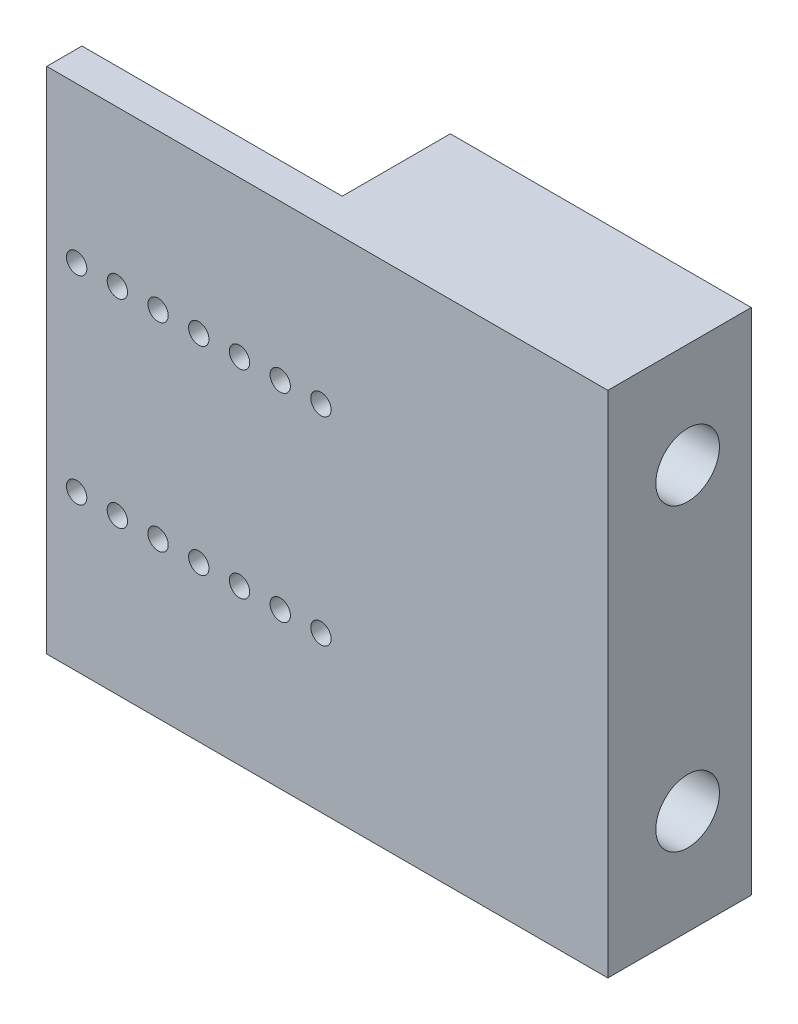
ISO-10303-21;
HEADER;
FILE_DESCRIPTION(('STEP AP214'),'2;1');
FILE_NAME('part.step','',(''),(''),'','','');
FILE_SCHEMA(('AUTOMOTIVE_DESIGN { 1 0 10303 214 1 1 1 1 }'));
ENDSEC;
DATA;
#1=APPLICATION_CONTEXT('core data for automotive mechanical design processes');
#2=APPLICATION_PROTOCOL_DEFINITION('international standard','automotive_design',2000,#1);
#3=PRODUCT_CONTEXT('',#1,'mechanical');
#4=PRODUCT('Part','Part','',(#3));
#5=PRODUCT_RELATED_PRODUCT_CATEGORY('part','',(#4));
#6=PRODUCT_DEFINITION_FORMATION('','',#4);
#7=PRODUCT_DEFINITION_CONTEXT('part definition',#1,'design');
#8=PRODUCT_DEFINITION('design','',#6,#7);
#9=PRODUCT_DEFINITION_SHAPE('','',#8);
#10=(LENGTH_UNIT() NAMED_UNIT(*) SI_UNIT(.MILLI.,.METRE.));
#11=(NAMED_UNIT(*) PLANE_ANGLE_UNIT() SI_UNIT($,.RADIAN.));
#12=(NAMED_UNIT(*) SI_UNIT($,.STERADIAN.) SOLID_ANGLE_UNIT());
#13=UNCERTAINTY_MEASURE_WITH_UNIT(LENGTH_MEASURE(1.E-05),#10,'distance_accuracy_value','');
#14=(GEOMETRIC_REPRESENTATION_CONTEXT(3) GLOBAL_UNCERTAINTY_ASSIGNED_CONTEXT((#13)) GLOBAL_UNIT_ASSIGNED_CONTEXT((#10,
#11,#12)) REPRESENTATION_CONTEXT('',''));
#15=CARTESIAN_POINT('',(0.,0.,0.));
#16=DIRECTION('',(0.,0.,1.));
#17=DIRECTION('',(1.,0.,0.));
#18=AXIS2_PLACEMENT_3D('',#15,#16,#17);
#19=CARTESIAN_POINT('',(0.,0.,-15.));
#20=DIRECTION('',(0.,0.,1.));
#21=DIRECTION('',(1.,0.,0.));
#22=AXIS2_PLACEMENT_3D('',#19,#20,#21);
#23=PLANE('',#22);
#24=DIRECTION('',(0.,-1.,0.));
#25=VECTOR('',#24,1.);
#26=CARTESIAN_POINT('',(40.9,58.8,-15.));
#27=LINE('',#26,#25);
#28=CARTESIAN_POINT('',(40.9,58.8,-15.));
#29=VERTEX_POINT('',#28);
#30=CARTESIAN_POINT('',(40.9,-21.2,-15.));
#31=VERTEX_POINT('',#30);
#32=EDGE_CURVE('E93',#29,#31,#27,.T.);
#33=ORIENTED_EDGE('',*,*,#32,.F.);
#34=DIRECTION('',(1.,0.,0.));
#35=VECTOR('',#34,1.);
#36=CARTESIAN_POINT('',(88.2,58.8,-15.));
#37=LINE('',#36,#35);
#38=CARTESIAN_POINT('',(88.2,58.8,-15.));
#39=VERTEX_POINT('',#38);
#40=EDGE_CURVE('E113',#29,#39,#37,.T.);
#41=ORIENTED_EDGE('',*,*,#40,.T.);
#42=DIRECTION('',(0.,-1.,0.));
#43=VECTOR('',#42,1.);
#44=CARTESIAN_POINT('',(88.2,-21.2,-15.));
#45=LINE('',#44,#43);
#46=CARTESIAN_POINT('',(88.2,-21.2,-15.));
#47=VERTEX_POINT('',#46);
#48=EDGE_CURVE('E112',#39,#47,#45,.T.);
#49=ORIENTED_EDGE('',*,*,#48,.T.);
#50=DIRECTION('',(-1.,0.,0.));
#51=VECTOR('',#50,1.);
#52=CARTESIAN_POINT('',(88.2,-21.2,-15.));
#53=LINE('',#52,#51);
#54=EDGE_CURVE('E106',#47,#31,#53,.T.);
#55=ORIENTED_EDGE('',*,*,#54,.T.);
#56=EDGE_LOOP('',(#33,#41,#49,#55));
#57=FACE_BOUND('',#56,.T.);
#58=ADVANCED_FACE('F38',(#57),#23,.F.);
#59=CARTESIAN_POINT('',(0.,0.,7.54));
#60=DIRECTION('',(0.,0.,1.));
#61=DIRECTION('',(1.,0.,0.));
#62=AXIS2_PLACEMENT_3D('',#59,#60,#61);
#63=PLANE('',#62);
#64=CARTESIAN_POINT('',(11.1,3.2,7.54));
#65=DIRECTION('',(0.,0.,1.));
#66=DIRECTION('',(-1.,0.,0.));
#67=AXIS2_PLACEMENT_3D('',#64,#65,#66);
#68=CIRCLE('',#67,1.6);
#69=CARTESIAN_POINT('',(9.49999999999999,3.2,7.54));
#70=VERTEX_POINT('',#69);
#71=EDGE_CURVE('E123',#70,#70,#68,.T.);
#72=ORIENTED_EDGE('',*,*,#71,.F.);
#73=EDGE_LOOP('',(#72));
#74=FACE_BOUND('',#73,.T.);
#75=CARTESIAN_POINT('',(23.9,3.2,7.54));
#76=DIRECTION('',(0.,0.,1.));
#77=DIRECTION('',(-1.,0.,0.));
#78=AXIS2_PLACEMENT_3D('',#75,#76,#77);
#79=CIRCLE('',#78,1.6);
#80=CARTESIAN_POINT('',(22.3,3.2,7.54));
#81=VERTEX_POINT('',#80);
#82=EDGE_CURVE('E129',#81,#81,#79,.T.);
#83=ORIENTED_EDGE('',*,*,#82,.F.);
#84=EDGE_LOOP('',(#83));
#85=FACE_BOUND('',#84,.T.);
#86=CARTESIAN_POINT('',(36.7,3.2,7.54));
#87=DIRECTION('',(0.,0.,1.));
#88=DIRECTION('',(-1.,0.,0.));
#89=AXIS2_PLACEMENT_3D('',#86,#87,#88);
#90=CIRCLE('',#89,1.6);
#91=CARTESIAN_POINT('',(35.1,3.2,7.54));
#92=VERTEX_POINT('',#91);
#93=EDGE_CURVE('E135',#92,#92,#90,.T.);
#94=ORIENTED_EDGE('',*,*,#93,.F.);
#95=EDGE_LOOP('',(#94));
#96=FACE_BOUND('',#95,.T.);
#97=CARTESIAN_POINT('',(36.7,34.4,7.54));
#98=DIRECTION('',(0.,0.,1.));
#99=DIRECTION('',(1.,0.,0.));
#100=AXIS2_PLACEMENT_3D('',#97,#98,#99);
#101=CIRCLE('',#100,1.6);
#102=CARTESIAN_POINT('',(38.3,34.4,7.54));
#103=VERTEX_POINT('',#102);
#104=EDGE_CURVE('E142',#103,#103,#101,.T.);
#105=ORIENTED_EDGE('',*,*,#104,.F.);
#106=EDGE_LOOP('',(#105));
#107=FACE_BOUND('',#106,.T.);
#108=CARTESIAN_POINT('',(23.9,34.4,7.54));
#109=DIRECTION('',(0.,0.,1.));
#110=DIRECTION('',(1.,0.,0.));
#111=AXIS2_PLACEMENT_3D('',#108,#109,#110);
#112=CIRCLE('',#111,1.6);
#113=CARTESIAN_POINT('',(25.5,34.4,7.54));
#114=VERTEX_POINT('',#113);
#115=EDGE_CURVE('E150',#114,#114,#112,.T.);
#116=ORIENTED_EDGE('',*,*,#115,.F.);
#117=EDGE_LOOP('',(#116));
#118=FACE_BOUND('',#117,.T.);
#119=CARTESIAN_POINT('',(11.1,34.4,7.54));
#120=DIRECTION('',(0.,0.,1.));
#121=DIRECTION('',(1.,0.,0.));
#122=AXIS2_PLACEMENT_3D('',#119,#120,#121);
#123=CIRCLE('',#122,1.6);
#124=CARTESIAN_POINT('',(12.7,34.4,7.54));
#125=VERTEX_POINT('',#124);
#126=EDGE_CURVE('E156',#125,#125,#123,.T.);
#127=ORIENTED_EDGE('',*,*,#126,.F.);
#128=EDGE_LOOP('',(#127));
#129=FACE_BOUND('',#128,.T.);
#130=CARTESIAN_POINT('',(4.7,34.4,7.54));
#131=DIRECTION('',(0.,0.,1.));
#132=DIRECTION('',(1.,0.,0.));
#133=AXIS2_PLACEMENT_3D('',#130,#131,#132);
#134=CIRCLE('',#133,1.6);
#135=CARTESIAN_POINT('',(6.3,34.4,7.54));
#136=VERTEX_POINT('',#135);
#137=EDGE_CURVE('E163',#136,#136,#134,.T.);
#138=ORIENTED_EDGE('',*,*,#137,.F.);
#139=EDGE_LOOP('',(#138));
#140=FACE_BOUND('',#139,.T.);
#141=DIRECTION('',(0.,-1.,0.));
#142=VECTOR('',#141,1.);
#143=CARTESIAN_POINT('',(0.,0.,7.54));
#144=LINE('',#143,#142);
#145=CARTESIAN_POINT('',(0.,58.8,7.54));
#146=VERTEX_POINT('',#145);
#147=CARTESIAN_POINT('',(0.,-21.2,7.54));
#148=VERTEX_POINT('',#147);
#149=EDGE_CURVE('E63',#146,#148,#144,.T.);
#150=ORIENTED_EDGE('',*,*,#149,.T.);
#151=DIRECTION('',(1.,0.,0.));
#152=VECTOR('',#151,1.);
#153=CARTESIAN_POINT('',(0.,-21.2,7.54));
#154=LINE('',#153,#152);
#155=CARTESIAN_POINT('',(88.2,-21.2,7.54));
#156=VERTEX_POINT('',#155);
#157=EDGE_CURVE('E169',#148,#156,#154,.T.);
#158=ORIENTED_EDGE('',*,*,#157,.T.);
#159=DIRECTION('',(0.,1.,0.));
#160=VECTOR('',#159,1.);
#161=CARTESIAN_POINT('',(88.2,-21.2,7.54));
#162=LINE('',#161,#160);
#163=CARTESIAN_POINT('',(88.2,58.8,7.54));
#164=VERTEX_POINT('',#163);
#165=EDGE_CURVE('E171',#156,#164,#162,.T.);
#166=ORIENTED_EDGE('',*,*,#165,.T.);
#167=DIRECTION('',(-1.,0.,0.));
#168=VECTOR('',#167,1.);
#169=CARTESIAN_POINT('',(0.,58.8,7.54));
#170=LINE('',#169,#168);
#171=EDGE_CURVE('E173',#164,#146,#170,.T.);
#172=ORIENTED_EDGE('',*,*,#171,.T.);
#173=EDGE_LOOP('',(#150,#158,#166,#172));
#174=FACE_BOUND('',#173,.T.);
#175=CARTESIAN_POINT('',(43.1,3.2,7.54));
#176=DIRECTION('',(0.,0.,1.));
#177=DIRECTION('',(-1.,0.,0.));
#178=AXIS2_PLACEMENT_3D('',#175,#176,#177);
#179=CIRCLE('',#178,1.6);
#180=CARTESIAN_POINT('',(41.5,3.2,7.54));
#181=VERTEX_POINT('',#180);
#182=EDGE_CURVE('E160',#181,#181,#179,.T.);
#183=ORIENTED_EDGE('',*,*,#182,.F.);
#184=EDGE_LOOP('',(#183));
#185=FACE_BOUND('',#184,.T.);
#186=CARTESIAN_POINT('',(17.5,34.4,7.54));
#187=DIRECTION('',(0.,0.,1.));
#188=DIRECTION('',(1.,0.,0.));
#189=AXIS2_PLACEMENT_3D('',#186,#187,#188);
#190=CIRCLE('',#189,1.6);
#191=CARTESIAN_POINT('',(19.1,34.4,7.54));
#192=VERTEX_POINT('',#191);
#193=EDGE_CURVE('E153',#192,#192,#190,.T.);
#194=ORIENTED_EDGE('',*,*,#193,.F.);
#195=EDGE_LOOP('',(#194));
#196=FACE_BOUND('',#195,.T.);
#197=CARTESIAN_POINT('',(30.3,34.4,7.54));
#198=DIRECTION('',(0.,0.,1.));
#199=DIRECTION('',(1.,0.,0.));
#200=AXIS2_PLACEMENT_3D('',#197,#198,#199);
#201=CIRCLE('',#200,1.6);
#202=CARTESIAN_POINT('',(31.9,34.4,7.54));
#203=VERTEX_POINT('',#202);
#204=EDGE_CURVE('E147',#203,#203,#201,.T.);
#205=ORIENTED_EDGE('',*,*,#204,.F.);
#206=EDGE_LOOP('',(#205));
#207=FACE_BOUND('',#206,.T.);
#208=CARTESIAN_POINT('',(43.1,34.4,7.54));
#209=DIRECTION('',(0.,0.,1.));
#210=DIRECTION('',(1.,0.,0.));
#211=AXIS2_PLACEMENT_3D('',#208,#209,#210);
#212=CIRCLE('',#211,1.6);
#213=CARTESIAN_POINT('',(44.7,34.4,7.54));
#214=VERTEX_POINT('',#213);
#215=EDGE_CURVE('E139',#214,#214,#212,.T.);
#216=ORIENTED_EDGE('',*,*,#215,.F.);
#217=EDGE_LOOP('',(#216));
#218=FACE_BOUND('',#217,.T.);
#219=CARTESIAN_POINT('',(30.3,3.2,7.54));
#220=DIRECTION('',(0.,0.,1.));
#221=DIRECTION('',(-1.,0.,0.));
#222=AXIS2_PLACEMENT_3D('',#219,#220,#221);
#223=CIRCLE('',#222,1.59999999999998);
#224=CARTESIAN_POINT('',(28.7,3.2,7.54));
#225=VERTEX_POINT('',#224);
#226=EDGE_CURVE('E132',#225,#225,#223,.T.);
#227=ORIENTED_EDGE('',*,*,#226,.F.);
#228=EDGE_LOOP('',(#227));
#229=FACE_BOUND('',#228,.T.);
#230=CARTESIAN_POINT('',(17.5,3.2,7.54));
#231=DIRECTION('',(0.,0.,1.));
#232=DIRECTION('',(-1.,0.,0.));
#233=AXIS2_PLACEMENT_3D('',#230,#231,#232);
#234=CIRCLE('',#233,1.6);
#235=CARTESIAN_POINT('',(15.9,3.2,7.54));
#236=VERTEX_POINT('',#235);
#237=EDGE_CURVE('E126',#236,#236,#234,.T.);
#238=ORIENTED_EDGE('',*,*,#237,.F.);
#239=EDGE_LOOP('',(#238));
#240=FACE_BOUND('',#239,.T.);
#241=CARTESIAN_POINT('',(4.7,3.2,7.54));
#242=DIRECTION('',(0.,0.,1.));
#243=DIRECTION('',(-1.,0.,0.));
#244=AXIS2_PLACEMENT_3D('',#241,#242,#243);
#245=CIRCLE('',#244,1.6);
#246=CARTESIAN_POINT('',(3.1,3.2,7.54));
#247=VERTEX_POINT('',#246);
#248=EDGE_CURVE('E115',#247,#247,#245,.T.);
#249=ORIENTED_EDGE('',*,*,#248,.F.);
#250=EDGE_LOOP('',(#249));
#251=FACE_BOUND('',#250,.T.);
#252=ADVANCED_FACE('F248',(#74,#85,#96,#107,#118,#129,#140,#174,#185,#196,#207,#218,#229,#240,
#251),#63,.T.);
#253=CARTESIAN_POINT('',(0.,-21.2,7.54));
#254=DIRECTION('',(0.,1.,0.));
#255=DIRECTION('',(0.,0.,1.));
#256=AXIS2_PLACEMENT_3D('',#253,#254,#255);
#257=PLANE('',#256);
#258=DIRECTION('',(0.,0.,-1.));
#259=VECTOR('',#258,1.);
#260=CARTESIAN_POINT('',(0.,-21.2,7.54));
#261=LINE('',#260,#259);
#262=CARTESIAN_POINT('',(0.,-21.2,2.));
#263=VERTEX_POINT('',#262);
#264=EDGE_CURVE('E11',#148,#263,#261,.T.);
#265=ORIENTED_EDGE('',*,*,#264,.T.);
#266=DIRECTION('',(-1.,0.,0.));
#267=VECTOR('',#266,1.);
#268=CARTESIAN_POINT('',(40.9,-21.2,2.));
#269=LINE('',#268,#267);
#270=CARTESIAN_POINT('',(40.9,-21.2,2.));
#271=VERTEX_POINT('',#270);
#272=EDGE_CURVE('E108',#271,#263,#269,.T.);
#273=ORIENTED_EDGE('',*,*,#272,.F.);
#274=DIRECTION('',(0.,0.,1.));
#275=VECTOR('',#274,1.);
#276=CARTESIAN_POINT('',(40.9,-21.2,-15.));
#277=LINE('',#276,#275);
#278=EDGE_CURVE('E96',#31,#271,#277,.T.);
#279=ORIENTED_EDGE('',*,*,#278,.F.);
#280=ORIENTED_EDGE('',*,*,#54,.F.);
#281=DIRECTION('',(0.,0.,-1.));
#282=VECTOR('',#281,1.);
#283=CARTESIAN_POINT('',(88.2,-21.2,7.54));
#284=LINE('',#283,#282);
#285=EDGE_CURVE('E47',#156,#47,#284,.T.);
#286=ORIENTED_EDGE('',*,*,#285,.F.);
#287=ORIENTED_EDGE('',*,*,#157,.F.);
#288=EDGE_LOOP('',(#265,#273,#279,#280,#286,#287));
#289=FACE_BOUND('',#288,.T.);
#290=ADVANCED_FACE('F40',(#289),#257,.F.);
#291=CARTESIAN_POINT('',(88.2,58.8,7.54));
#292=DIRECTION('',(-1.,0.,0.));
#293=DIRECTION('',(0.,0.,1.));
#294=AXIS2_PLACEMENT_3D('',#291,#292,#293);
#295=PLANE('',#294);
#296=CARTESIAN_POINT('',(88.2,42.36,-5.));
#297=DIRECTION('',(-1.,0.,0.));
#298=DIRECTION('',(0.,0.,1.));
#299=AXIS2_PLACEMENT_3D('',#296,#297,#298);
#300=CIRCLE('',#299,5.);
#301=CARTESIAN_POINT('',(88.2,42.36,0.));
#302=VERTEX_POINT('',#301);
#303=EDGE_CURVE('E195',#302,#302,#300,.T.);
#304=ORIENTED_EDGE('',*,*,#303,.T.);
#305=EDGE_LOOP('',(#304));
#306=FACE_BOUND('',#305,.T.);
#307=CARTESIAN_POINT('',(88.2,-4.76,-5.));
#308=DIRECTION('',(-1.,0.,0.));
#309=DIRECTION('',(0.,0.,1.));
#310=AXIS2_PLACEMENT_3D('',#307,#308,#309);
#311=CIRCLE('',#310,5.);
#312=CARTESIAN_POINT('',(88.2,-4.76,0.));
#313=VERTEX_POINT('',#312);
#314=EDGE_CURVE('E187',#313,#313,#311,.T.);
#315=ORIENTED_EDGE('',*,*,#314,.T.);
#316=EDGE_LOOP('',(#315));
#317=FACE_BOUND('',#316,.T.);
#318=ORIENTED_EDGE('',*,*,#285,.T.);
#319=ORIENTED_EDGE('',*,*,#48,.F.);
#320=DIRECTION('',(0.,0.,-1.));
#321=VECTOR('',#320,1.);
#322=CARTESIAN_POINT('',(88.2,58.8,7.54));
#323=LINE('',#322,#321);
#324=EDGE_CURVE('E177',#164,#39,#323,.T.);
#325=ORIENTED_EDGE('',*,*,#324,.F.);
#326=ORIENTED_EDGE('',*,*,#165,.F.);
#327=EDGE_LOOP('',(#318,#319,#325,#326));
#328=FACE_BOUND('',#327,.T.);
#329=ADVANCED_FACE('F307',(#306,#317,#328),#295,.F.);
#330=CARTESIAN_POINT('',(0.,58.8,7.54));
#331=DIRECTION('',(0.,-1.,0.));
#332=DIRECTION('',(0.,0.,-1.));
#333=AXIS2_PLACEMENT_3D('',#330,#331,#332);
#334=PLANE('',#333);
#335=DIRECTION('',(0.,0.,-1.));
#336=VECTOR('',#335,1.);
#337=CARTESIAN_POINT('',(40.9,58.8,0.));
#338=LINE('',#337,#336);
#339=CARTESIAN_POINT('',(40.9,58.8,2.));
#340=VERTEX_POINT('',#339);
#341=EDGE_CURVE('E55',#340,#29,#338,.T.);
#342=ORIENTED_EDGE('',*,*,#341,.F.);
#343=DIRECTION('',(-1.,0.,0.));
#344=VECTOR('',#343,1.);
#345=CARTESIAN_POINT('',(40.9,58.8,2.));
#346=LINE('',#345,#344);
#347=CARTESIAN_POINT('',(0.,58.8,2.));
#348=VERTEX_POINT('',#347);
#349=EDGE_CURVE('E184',#340,#348,#346,.T.);
#350=ORIENTED_EDGE('',*,*,#349,.T.);
#351=DIRECTION('',(0.,0.,-1.));
#352=VECTOR('',#351,1.);
#353=CARTESIAN_POINT('',(0.,58.8,7.54));
#354=LINE('',#353,#352);
#355=EDGE_CURVE('E175',#146,#348,#354,.T.);
#356=ORIENTED_EDGE('',*,*,#355,.F.);
#357=ORIENTED_EDGE('',*,*,#171,.F.);
#358=ORIENTED_EDGE('',*,*,#324,.T.);
#359=ORIENTED_EDGE('',*,*,#40,.F.);
#360=EDGE_LOOP('',(#342,#350,#356,#357,#358,#359));
#361=FACE_BOUND('',#360,.T.);
#362=ADVANCED_FACE('F309',(#361),#334,.F.);
#363=CARTESIAN_POINT('',(0.,37.6,7.54));
#364=DIRECTION('',(1.,0.,0.));
#365=DIRECTION('',(0.,0.,-1.));
#366=AXIS2_PLACEMENT_3D('',#363,#364,#365);
#367=PLANE('',#366);
#368=ORIENTED_EDGE('',*,*,#355,.T.);
#369=DIRECTION('',(0.,1.,0.));
#370=VECTOR('',#369,1.);
#371=CARTESIAN_POINT('',(0.,58.8,2.));
#372=LINE('',#371,#370);
#373=EDGE_CURVE('E199',#263,#348,#372,.T.);
#374=ORIENTED_EDGE('',*,*,#373,.F.);
#375=ORIENTED_EDGE('',*,*,#264,.F.);
#376=ORIENTED_EDGE('',*,*,#149,.F.);
#377=EDGE_LOOP('',(#368,#374,#375,#376));
#378=FACE_BOUND('',#377,.T.);
#379=ADVANCED_FACE('F244',(#378),#367,.F.);
#380=CARTESIAN_POINT('',(4.7,34.4,7.54));
#381=DIRECTION('',(0.,0.,-1.));
#382=DIRECTION('',(-1.,0.,0.));
#383=AXIS2_PLACEMENT_3D('',#380,#381,#382);
#384=CYLINDRICAL_SURFACE('',#383,1.6);
#385=CARTESIAN_POINT('',(4.7,34.4,2.));
#386=DIRECTION('',(0.,0.,1.));
#387=DIRECTION('',(1.,0.,0.));
#388=AXIS2_PLACEMENT_3D('',#385,#386,#387);
#389=CIRCLE('',#388,1.6);
#390=CARTESIAN_POINT('',(6.3,34.4,2.));
#391=VERTEX_POINT('',#390);
#392=EDGE_CURVE('E117',#391,#391,#389,.T.);
#393=ORIENTED_EDGE('',*,*,#392,.F.);
#394=EDGE_LOOP('',(#393));
#395=FACE_BOUND('',#394,.T.);
#396=ORIENTED_EDGE('',*,*,#137,.T.);
#397=EDGE_LOOP('',(#396));
#398=FACE_BOUND('',#397,.T.);
#399=ADVANCED_FACE('F240',(#395,#398),#384,.F.);
#400=CARTESIAN_POINT('',(43.1,3.2,7.54));
#401=DIRECTION('',(0.,0.,-1.));
#402=DIRECTION('',(-1.,0.,0.));
#403=AXIS2_PLACEMENT_3D('',#400,#401,#402);
#404=CYLINDRICAL_SURFACE('',#403,1.6);
#405=ORIENTED_EDGE('',*,*,#182,.T.);
#406=EDGE_LOOP('',(#405));
#407=FACE_BOUND('',#406,.T.);
#408=CARTESIAN_POINT('',(43.1,3.2,0.));
#409=DIRECTION('',(0.,0.,1.));
#410=DIRECTION('',(-1.,0.,0.));
#411=AXIS2_PLACEMENT_3D('',#408,#409,#410);
#412=CIRCLE('',#411,1.6);
#413=CARTESIAN_POINT('',(41.5,3.2,0.));
#414=VERTEX_POINT('',#413);
#415=EDGE_CURVE('E159',#414,#414,#412,.T.);
#416=ORIENTED_EDGE('',*,*,#415,.F.);
#417=EDGE_LOOP('',(#416));
#418=FACE_BOUND('',#417,.T.);
#419=ADVANCED_FACE('F243',(#407,#418),#404,.F.);
#420=CARTESIAN_POINT('',(11.1,34.4,7.54));
#421=DIRECTION('',(0.,0.,-1.));
#422=DIRECTION('',(-1.,0.,0.));
#423=AXIS2_PLACEMENT_3D('',#420,#421,#422);
#424=CYLINDRICAL_SURFACE('',#423,1.6);
#425=CARTESIAN_POINT('',(11.1,34.4,2.));
#426=DIRECTION('',(0.,0.,1.));
#427=DIRECTION('',(1.,0.,0.));
#428=AXIS2_PLACEMENT_3D('',#425,#426,#427);
#429=CIRCLE('',#428,1.6);
#430=CARTESIAN_POINT('',(12.7,34.4,2.));
#431=VERTEX_POINT('',#430);
#432=EDGE_CURVE('E232',#431,#431,#429,.T.);
#433=ORIENTED_EDGE('',*,*,#432,.F.);
#434=EDGE_LOOP('',(#433));
#435=FACE_BOUND('',#434,.T.);
#436=ORIENTED_EDGE('',*,*,#126,.T.);
#437=EDGE_LOOP('',(#436));
#438=FACE_BOUND('',#437,.T.);
#439=ADVANCED_FACE('F327',(#435,#438),#424,.F.);
#440=CARTESIAN_POINT('',(17.5,34.4,7.54));
#441=DIRECTION('',(0.,0.,-1.));
#442=DIRECTION('',(-1.,0.,0.));
#443=AXIS2_PLACEMENT_3D('',#440,#441,#442);
#444=CYLINDRICAL_SURFACE('',#443,1.6);
#445=CARTESIAN_POINT('',(17.5,34.4,2.));
#446=DIRECTION('',(0.,0.,1.));
#447=DIRECTION('',(1.,0.,0.));
#448=AXIS2_PLACEMENT_3D('',#445,#446,#447);
#449=CIRCLE('',#448,1.6);
#450=CARTESIAN_POINT('',(19.1,34.4,2.));
#451=VERTEX_POINT('',#450);
#452=EDGE_CURVE('E229',#451,#451,#449,.T.);
#453=ORIENTED_EDGE('',*,*,#452,.F.);
#454=EDGE_LOOP('',(#453));
#455=FACE_BOUND('',#454,.T.);
#456=ORIENTED_EDGE('',*,*,#193,.T.);
#457=EDGE_LOOP('',(#456));
#458=FACE_BOUND('',#457,.T.);
#459=ADVANCED_FACE('F331',(#455,#458),#444,.F.);
#460=CARTESIAN_POINT('',(23.9,34.4,7.54));
#461=DIRECTION('',(0.,0.,-1.));
#462=DIRECTION('',(-1.,0.,0.));
#463=AXIS2_PLACEMENT_3D('',#460,#461,#462);
#464=CYLINDRICAL_SURFACE('',#463,1.6);
#465=CARTESIAN_POINT('',(23.9,34.4,2.));
#466=DIRECTION('',(0.,0.,1.));
#467=DIRECTION('',(1.,0.,0.));
#468=AXIS2_PLACEMENT_3D('',#465,#466,#467);
#469=CIRCLE('',#468,1.6);
#470=CARTESIAN_POINT('',(25.5,34.4,2.));
#471=VERTEX_POINT('',#470);
#472=EDGE_CURVE('E226',#471,#471,#469,.T.);
#473=ORIENTED_EDGE('',*,*,#472,.F.);
#474=EDGE_LOOP('',(#473));
#475=FACE_BOUND('',#474,.T.);
#476=ORIENTED_EDGE('',*,*,#115,.T.);
#477=EDGE_LOOP('',(#476));
#478=FACE_BOUND('',#477,.T.);
#479=ADVANCED_FACE('F335',(#475,#478),#464,.F.);
#480=CARTESIAN_POINT('',(30.3,34.4,7.54));
#481=DIRECTION('',(0.,0.,-1.));
#482=DIRECTION('',(-1.,0.,0.));
#483=AXIS2_PLACEMENT_3D('',#480,#481,#482);
#484=CYLINDRICAL_SURFACE('',#483,1.6);
#485=CARTESIAN_POINT('',(30.3,34.4,2.));
#486=DIRECTION('',(0.,0.,1.));
#487=DIRECTION('',(1.,0.,0.));
#488=AXIS2_PLACEMENT_3D('',#485,#486,#487);
#489=CIRCLE('',#488,1.6);
#490=CARTESIAN_POINT('',(31.9,34.4,2.));
#491=VERTEX_POINT('',#490);
#492=EDGE_CURVE('E223',#491,#491,#489,.T.);
#493=ORIENTED_EDGE('',*,*,#492,.F.);
#494=EDGE_LOOP('',(#493));
#495=FACE_BOUND('',#494,.T.);
#496=ORIENTED_EDGE('',*,*,#204,.T.);
#497=EDGE_LOOP('',(#496));
#498=FACE_BOUND('',#497,.T.);
#499=ADVANCED_FACE('F339',(#495,#498),#484,.F.);
#500=CARTESIAN_POINT('',(36.7,34.4,7.54));
#501=DIRECTION('',(0.,0.,-1.));
#502=DIRECTION('',(-1.,0.,0.));
#503=AXIS2_PLACEMENT_3D('',#500,#501,#502);
#504=CYLINDRICAL_SURFACE('',#503,1.6);
#505=CARTESIAN_POINT('',(36.7,34.4,2.));
#506=DIRECTION('',(0.,0.,1.));
#507=DIRECTION('',(1.,0.,0.));
#508=AXIS2_PLACEMENT_3D('',#505,#506,#507);
#509=CIRCLE('',#508,1.6);
#510=CARTESIAN_POINT('',(38.3,34.4,2.));
#511=VERTEX_POINT('',#510);
#512=EDGE_CURVE('E220',#511,#511,#509,.T.);
#513=ORIENTED_EDGE('',*,*,#512,.F.);
#514=EDGE_LOOP('',(#513));
#515=FACE_BOUND('',#514,.T.);
#516=ORIENTED_EDGE('',*,*,#104,.T.);
#517=EDGE_LOOP('',(#516));
#518=FACE_BOUND('',#517,.T.);
#519=ADVANCED_FACE('F343',(#515,#518),#504,.F.);
#520=CARTESIAN_POINT('',(43.1,34.4,7.54));
#521=DIRECTION('',(0.,0.,-1.));
#522=DIRECTION('',(-1.,0.,0.));
#523=AXIS2_PLACEMENT_3D('',#520,#521,#522);
#524=CYLINDRICAL_SURFACE('',#523,1.6);
#525=ORIENTED_EDGE('',*,*,#215,.T.);
#526=EDGE_LOOP('',(#525));
#527=FACE_BOUND('',#526,.T.);
#528=CARTESIAN_POINT('',(43.1,34.4,0.));
#529=DIRECTION('',(0.,0.,1.));
#530=DIRECTION('',(1.,0.,0.));
#531=AXIS2_PLACEMENT_3D('',#528,#529,#530);
#532=CIRCLE('',#531,1.6);
#533=CARTESIAN_POINT('',(44.7,34.4,0.));
#534=VERTEX_POINT('',#533);
#535=EDGE_CURVE('E138',#534,#534,#532,.T.);
#536=ORIENTED_EDGE('',*,*,#535,.F.);
#537=EDGE_LOOP('',(#536));
#538=FACE_BOUND('',#537,.T.);
#539=ADVANCED_FACE('F347',(#527,#538),#524,.F.);
#540=CARTESIAN_POINT('',(36.7,3.2,7.54));
#541=DIRECTION('',(0.,0.,-1.));
#542=DIRECTION('',(-1.,0.,0.));
#543=AXIS2_PLACEMENT_3D('',#540,#541,#542);
#544=CYLINDRICAL_SURFACE('',#543,1.6);
#545=CARTESIAN_POINT('',(36.7,3.2,2.));
#546=DIRECTION('',(0.,0.,1.));
#547=DIRECTION('',(1.,0.,0.));
#548=AXIS2_PLACEMENT_3D('',#545,#546,#547);
#549=CIRCLE('',#548,1.6);
#550=CARTESIAN_POINT('',(38.3,3.2,2.));
#551=VERTEX_POINT('',#550);
#552=EDGE_CURVE('E217',#551,#551,#549,.T.);
#553=ORIENTED_EDGE('',*,*,#552,.F.);
#554=EDGE_LOOP('',(#553));
#555=FACE_BOUND('',#554,.T.);
#556=ORIENTED_EDGE('',*,*,#93,.T.);
#557=EDGE_LOOP('',(#556));
#558=FACE_BOUND('',#557,.T.);
#559=ADVANCED_FACE('F351',(#555,#558),#544,.F.);
#560=CARTESIAN_POINT('',(30.3,3.2,7.54));
#561=DIRECTION('',(0.,0.,-1.));
#562=DIRECTION('',(-1.,0.,0.));
#563=AXIS2_PLACEMENT_3D('',#560,#561,#562);
#564=CYLINDRICAL_SURFACE('',#563,1.59999999999998);
#565=CARTESIAN_POINT('',(30.3,3.2,2.));
#566=DIRECTION('',(0.,0.,1.));
#567=DIRECTION('',(1.,0.,0.));
#568=AXIS2_PLACEMENT_3D('',#565,#566,#567);
#569=CIRCLE('',#568,1.59999999999998);
#570=CARTESIAN_POINT('',(31.9,3.2,2.));
#571=VERTEX_POINT('',#570);
#572=EDGE_CURVE('E214',#571,#571,#569,.T.);
#573=ORIENTED_EDGE('',*,*,#572,.F.);
#574=EDGE_LOOP('',(#573));
#575=FACE_BOUND('',#574,.T.);
#576=ORIENTED_EDGE('',*,*,#226,.T.);
#577=EDGE_LOOP('',(#576));
#578=FACE_BOUND('',#577,.T.);
#579=ADVANCED_FACE('F355',(#575,#578),#564,.F.);
#580=CARTESIAN_POINT('',(23.9,3.2,7.54));
#581=DIRECTION('',(0.,0.,-1.));
#582=DIRECTION('',(-1.,0.,0.));
#583=AXIS2_PLACEMENT_3D('',#580,#581,#582);
#584=CYLINDRICAL_SURFACE('',#583,1.6);
#585=CARTESIAN_POINT('',(23.9,3.2,2.));
#586=DIRECTION('',(0.,0.,1.));
#587=DIRECTION('',(1.,0.,0.));
#588=AXIS2_PLACEMENT_3D('',#585,#586,#587);
#589=CIRCLE('',#588,1.6);
#590=CARTESIAN_POINT('',(25.5,3.2,2.));
#591=VERTEX_POINT('',#590);
#592=EDGE_CURVE('E211',#591,#591,#589,.T.);
#593=ORIENTED_EDGE('',*,*,#592,.F.);
#594=EDGE_LOOP('',(#593));
#595=FACE_BOUND('',#594,.T.);
#596=ORIENTED_EDGE('',*,*,#82,.T.);
#597=EDGE_LOOP('',(#596));
#598=FACE_BOUND('',#597,.T.);
#599=ADVANCED_FACE('F359',(#595,#598),#584,.F.);
#600=CARTESIAN_POINT('',(17.5,3.2,7.54));
#601=DIRECTION('',(0.,0.,-1.));
#602=DIRECTION('',(-1.,0.,0.));
#603=AXIS2_PLACEMENT_3D('',#600,#601,#602);
#604=CYLINDRICAL_SURFACE('',#603,1.6);
#605=CARTESIAN_POINT('',(17.5,3.2,2.));
#606=DIRECTION('',(0.,0.,1.));
#607=DIRECTION('',(1.,0.,0.));
#608=AXIS2_PLACEMENT_3D('',#605,#606,#607);
#609=CIRCLE('',#608,1.6);
#610=CARTESIAN_POINT('',(19.1,3.2,2.));
#611=VERTEX_POINT('',#610);
#612=EDGE_CURVE('E208',#611,#611,#609,.T.);
#613=ORIENTED_EDGE('',*,*,#612,.F.);
#614=EDGE_LOOP('',(#613));
#615=FACE_BOUND('',#614,.T.);
#616=ORIENTED_EDGE('',*,*,#237,.T.);
#617=EDGE_LOOP('',(#616));
#618=FACE_BOUND('',#617,.T.);
#619=ADVANCED_FACE('F281',(#615,#618),#604,.F.);
#620=CARTESIAN_POINT('',(11.1,3.2,7.54));
#621=DIRECTION('',(0.,0.,-1.));
#622=DIRECTION('',(-1.,0.,0.));
#623=AXIS2_PLACEMENT_3D('',#620,#621,#622);
#624=CYLINDRICAL_SURFACE('',#623,1.6);
#625=CARTESIAN_POINT('',(11.1,3.2,2.));
#626=DIRECTION('',(0.,0.,1.));
#627=DIRECTION('',(1.,0.,0.));
#628=AXIS2_PLACEMENT_3D('',#625,#626,#627);
#629=CIRCLE('',#628,1.6);
#630=CARTESIAN_POINT('',(12.7,3.2,2.));
#631=VERTEX_POINT('',#630);
#632=EDGE_CURVE('E183',#631,#631,#629,.T.);
#633=ORIENTED_EDGE('',*,*,#632,.F.);
#634=EDGE_LOOP('',(#633));
#635=FACE_BOUND('',#634,.T.);
#636=ORIENTED_EDGE('',*,*,#71,.T.);
#637=EDGE_LOOP('',(#636));
#638=FACE_BOUND('',#637,.T.);
#639=ADVANCED_FACE('F271',(#635,#638),#624,.F.);
#640=CARTESIAN_POINT('',(4.7,3.2,7.54));
#641=DIRECTION('',(0.,0.,-1.));
#642=DIRECTION('',(-1.,0.,0.));
#643=AXIS2_PLACEMENT_3D('',#640,#641,#642);
#644=CYLINDRICAL_SURFACE('',#643,1.6);
#645=CARTESIAN_POINT('',(4.7,3.2,2.));
#646=DIRECTION('',(0.,0.,1.));
#647=DIRECTION('',(1.,0.,0.));
#648=AXIS2_PLACEMENT_3D('',#645,#646,#647);
#649=CIRCLE('',#648,1.6);
#650=CARTESIAN_POINT('',(6.3,3.2,2.));
#651=VERTEX_POINT('',#650);
#652=EDGE_CURVE('E181',#651,#651,#649,.T.);
#653=ORIENTED_EDGE('',*,*,#652,.F.);
#654=EDGE_LOOP('',(#653));
#655=FACE_BOUND('',#654,.T.);
#656=ORIENTED_EDGE('',*,*,#248,.T.);
#657=EDGE_LOOP('',(#656));
#658=FACE_BOUND('',#657,.T.);
#659=ADVANCED_FACE('F268',(#655,#658),#644,.F.);
#660=CARTESIAN_POINT('',(0.,0.,0.));
#661=DIRECTION('',(0.,0.,1.));
#662=DIRECTION('',(1.,0.,0.));
#663=AXIS2_PLACEMENT_3D('',#660,#661,#662);
#664=PLANE('',#663);
#665=ORIENTED_EDGE('',*,*,#535,.T.);
#666=EDGE_LOOP('',(#665));
#667=FACE_BOUND('',#666,.T.);
#668=ADVANCED_FACE('F270',(#667),#664,.T.);
#669=ORIENTED_EDGE('',*,*,#415,.T.);
#670=EDGE_LOOP('',(#669));
#671=FACE_BOUND('',#670,.T.);
#672=ADVANCED_FACE('F278',(#671),#664,.T.);
#673=CARTESIAN_POINT('',(40.9,58.8,2.));
#674=DIRECTION('',(0.,0.,1.));
#675=DIRECTION('',(1.,0.,0.));
#676=AXIS2_PLACEMENT_3D('',#673,#674,#675);
#677=PLANE('',#676);
#678=ORIENTED_EDGE('',*,*,#392,.T.);
#679=EDGE_LOOP('',(#678));
#680=FACE_BOUND('',#679,.T.);
#681=ORIENTED_EDGE('',*,*,#432,.T.);
#682=EDGE_LOOP('',(#681));
#683=FACE_BOUND('',#682,.T.);
#684=ORIENTED_EDGE('',*,*,#452,.T.);
#685=EDGE_LOOP('',(#684));
#686=FACE_BOUND('',#685,.T.);
#687=ORIENTED_EDGE('',*,*,#472,.T.);
#688=EDGE_LOOP('',(#687));
#689=FACE_BOUND('',#688,.T.);
#690=ORIENTED_EDGE('',*,*,#492,.T.);
#691=EDGE_LOOP('',(#690));
#692=FACE_BOUND('',#691,.T.);
#693=ORIENTED_EDGE('',*,*,#512,.T.);
#694=EDGE_LOOP('',(#693));
#695=FACE_BOUND('',#694,.T.);
#696=ORIENTED_EDGE('',*,*,#552,.T.);
#697=EDGE_LOOP('',(#696));
#698=FACE_BOUND('',#697,.T.);
#699=ORIENTED_EDGE('',*,*,#572,.T.);
#700=EDGE_LOOP('',(#699));
#701=FACE_BOUND('',#700,.T.);
#702=ORIENTED_EDGE('',*,*,#592,.T.);
#703=EDGE_LOOP('',(#702));
#704=FACE_BOUND('',#703,.T.);
#705=ORIENTED_EDGE('',*,*,#612,.T.);
#706=EDGE_LOOP('',(#705));
#707=FACE_BOUND('',#706,.T.);
#708=ORIENTED_EDGE('',*,*,#632,.T.);
#709=EDGE_LOOP('',(#708));
#710=FACE_BOUND('',#709,.T.);
#711=ORIENTED_EDGE('',*,*,#652,.T.);
#712=EDGE_LOOP('',(#711));
#713=FACE_BOUND('',#712,.T.);
#714=ORIENTED_EDGE('',*,*,#373,.T.);
#715=ORIENTED_EDGE('',*,*,#349,.F.);
#716=DIRECTION('',(0.,1.,0.));
#717=VECTOR('',#716,1.);
#718=CARTESIAN_POINT('',(40.9,58.8,2.));
#719=LINE('',#718,#717);
#720=EDGE_CURVE('E109',#271,#340,#719,.T.);
#721=ORIENTED_EDGE('',*,*,#720,.F.);
#722=ORIENTED_EDGE('',*,*,#272,.T.);
#723=EDGE_LOOP('',(#714,#715,#721,#722));
#724=FACE_BOUND('',#723,.T.);
#725=ADVANCED_FACE('F237',(#680,#683,#686,#689,#692,#695,#698,#701,#704,#707,#710,#713,#724),
#677,.F.);
#726=CARTESIAN_POINT('',(40.9,0.,0.));
#727=DIRECTION('',(-1.,0.,0.));
#728=DIRECTION('',(0.,0.,1.));
#729=AXIS2_PLACEMENT_3D('',#726,#727,#728);
#730=PLANE('',#729);
#731=CARTESIAN_POINT('',(40.9,42.36,-5.));
#732=DIRECTION('',(-1.,0.,0.));
#733=DIRECTION('',(0.,0.,1.));
#734=AXIS2_PLACEMENT_3D('',#731,#732,#733);
#735=CIRCLE('',#734,5.);
#736=CARTESIAN_POINT('',(40.9,42.36,0.));
#737=VERTEX_POINT('',#736);
#738=EDGE_CURVE('E42',#737,#737,#735,.T.);
#739=ORIENTED_EDGE('',*,*,#738,.F.);
#740=EDGE_LOOP('',(#739));
#741=FACE_BOUND('',#740,.T.);
#742=CARTESIAN_POINT('',(40.9,-4.76,-5.));
#743=DIRECTION('',(-1.,0.,0.));
#744=DIRECTION('',(0.,0.,1.));
#745=AXIS2_PLACEMENT_3D('',#742,#743,#744);
#746=CIRCLE('',#745,5.);
#747=CARTESIAN_POINT('',(40.9,-4.76,0.));
#748=VERTEX_POINT('',#747);
#749=EDGE_CURVE('E185',#748,#748,#746,.T.);
#750=ORIENTED_EDGE('',*,*,#749,.F.);
#751=EDGE_LOOP('',(#750));
#752=FACE_BOUND('',#751,.T.);
#753=ORIENTED_EDGE('',*,*,#341,.T.);
#754=ORIENTED_EDGE('',*,*,#32,.T.);
#755=ORIENTED_EDGE('',*,*,#278,.T.);
#756=ORIENTED_EDGE('',*,*,#720,.T.);
#757=EDGE_LOOP('',(#753,#754,#755,#756));
#758=FACE_BOUND('',#757,.T.);
#759=ADVANCED_FACE('F95',(#741,#752,#758),#730,.T.);
#760=CARTESIAN_POINT('',(94.8,-4.76,-5.));
#761=DIRECTION('',(-1.,0.,0.));
#762=DIRECTION('',(0.,0.,1.));
#763=AXIS2_PLACEMENT_3D('',#760,#761,#762);
#764=CYLINDRICAL_SURFACE('',#763,5.);
#765=ORIENTED_EDGE('',*,*,#749,.T.);
#766=EDGE_LOOP('',(#765));
#767=FACE_BOUND('',#766,.T.);
#768=ORIENTED_EDGE('',*,*,#314,.F.);
#769=EDGE_LOOP('',(#768));
#770=FACE_BOUND('',#769,.T.);
#771=ADVANCED_FACE('F294',(#767,#770),#764,.F.);
#772=CARTESIAN_POINT('',(94.8,42.36,-5.));
#773=DIRECTION('',(-1.,0.,0.));
#774=DIRECTION('',(0.,0.,1.));
#775=AXIS2_PLACEMENT_3D('',#772,#773,#774);
#776=CYLINDRICAL_SURFACE('',#775,5.);
#777=ORIENTED_EDGE('',*,*,#738,.T.);
#778=EDGE_LOOP('',(#777));
#779=FACE_BOUND('',#778,.T.);
#780=ORIENTED_EDGE('',*,*,#303,.F.);
#781=EDGE_LOOP('',(#780));
#782=FACE_BOUND('',#781,.T.);
#783=ADVANCED_FACE('F298',(#779,#782),#776,.F.);
#784=CLOSED_SHELL('',(#58,#252,#290,#329,#362,#379,#399,#419,#439,#459,#479,#499,#519,#539,#559,
#579,#599,#619,#639,#659,#668,#672,#725,#759,#771,#783));
#785=MANIFOLD_SOLID_BREP('B2',#784);
#786=ADVANCED_BREP_SHAPE_REPRESENTATION('',(#18,#785),#14);
#787=SHAPE_DEFINITION_REPRESENTATION(#9,#786);
ENDSEC;
END-ISO-10303-21;
